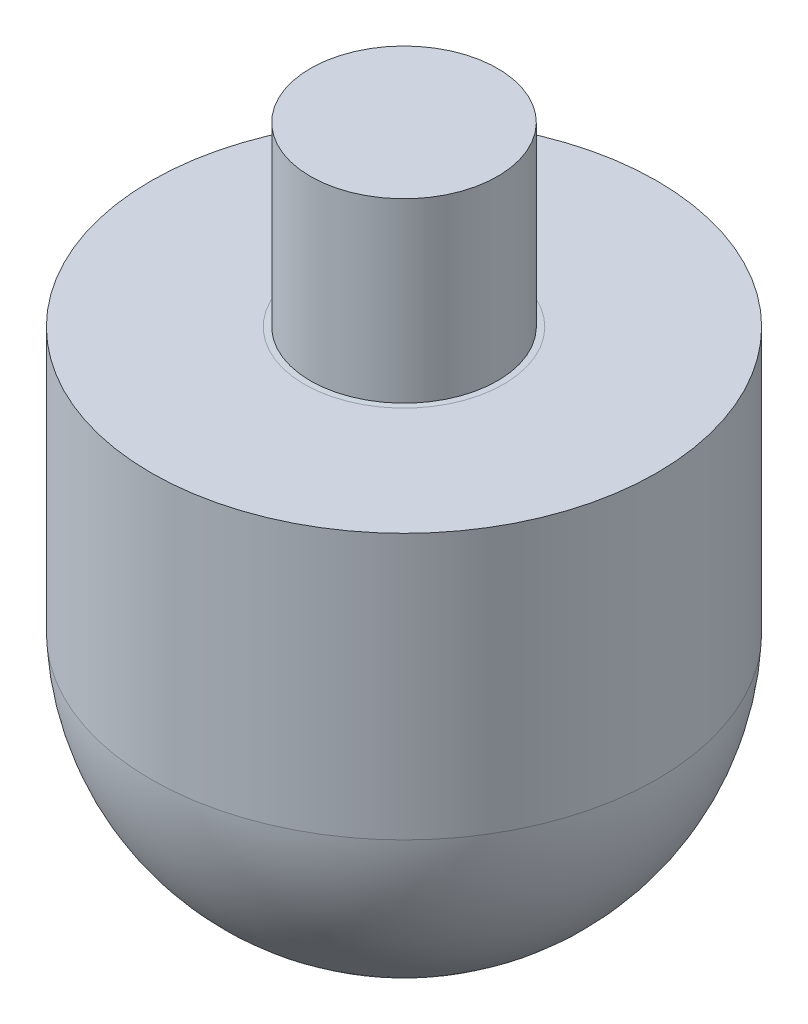
ISO-10303-21;
HEADER;
FILE_DESCRIPTION(('STEP AP214'),'2;1');
FILE_NAME('part.step','',(''),(''),'','','');
FILE_SCHEMA(('AUTOMOTIVE_DESIGN { 1 0 10303 214 1 1 1 1 }'));
ENDSEC;
DATA;
#1=APPLICATION_CONTEXT('core data for automotive mechanical design processes');
#2=APPLICATION_PROTOCOL_DEFINITION('international standard','automotive_design',2000,#1);
#3=PRODUCT_CONTEXT('',#1,'mechanical');
#4=PRODUCT('Part','Part','',(#3));
#5=PRODUCT_RELATED_PRODUCT_CATEGORY('part','',(#4));
#6=PRODUCT_DEFINITION_FORMATION('','',#4);
#7=PRODUCT_DEFINITION_CONTEXT('part definition',#1,'design');
#8=PRODUCT_DEFINITION('design','',#6,#7);
#9=PRODUCT_DEFINITION_SHAPE('','',#8);
#10=(LENGTH_UNIT() NAMED_UNIT(*) SI_UNIT(.MILLI.,.METRE.));
#11=(NAMED_UNIT(*) PLANE_ANGLE_UNIT() SI_UNIT($,.RADIAN.));
#12=(NAMED_UNIT(*) SI_UNIT($,.STERADIAN.) SOLID_ANGLE_UNIT());
#13=UNCERTAINTY_MEASURE_WITH_UNIT(LENGTH_MEASURE(1.E-05),#10,'distance_accuracy_value','');
#14=(GEOMETRIC_REPRESENTATION_CONTEXT(3) GLOBAL_UNCERTAINTY_ASSIGNED_CONTEXT((#13)) GLOBAL_UNIT_ASSIGNED_CONTEXT((#10,
#11,#12)) REPRESENTATION_CONTEXT('',''));
#15=CARTESIAN_POINT('',(0.,0.,0.));
#16=DIRECTION('',(0.,0.,1.));
#17=DIRECTION('',(1.,0.,0.));
#18=AXIS2_PLACEMENT_3D('',#15,#16,#17);
#19=CARTESIAN_POINT('',(14.2859437507659,14.9977518762108,0.));
#20=DIRECTION('',(0.,-1.,0.));
#21=DIRECTION('',(0.,0.,-1.));
#22=AXIS2_PLACEMENT_3D('',#19,#20,#21);
#23=PLANE('',#22);
#24=CARTESIAN_POINT('',(0.,14.9977518762108,0.));
#25=DIRECTION('',(0.,1.,0.));
#26=DIRECTION('',(0.,0.,1.));
#27=AXIS2_PLACEMENT_3D('',#24,#25,#26);
#28=CIRCLE('',#27,5.62499999999999);
#29=CARTESIAN_POINT('',(0.,14.9977518762108,5.62499999999999));
#30=VERTEX_POINT('',#29);
#31=EDGE_CURVE('E10',#30,#30,#28,.T.);
#32=ORIENTED_EDGE('',*,*,#31,.F.);
#33=EDGE_LOOP('',(#32));
#34=FACE_BOUND('',#33,.T.);
#35=CARTESIAN_POINT('',(0.,14.9977518762108,0.));
#36=DIRECTION('',(0.,1.,0.));
#37=DIRECTION('',(0.,0.,1.));
#38=AXIS2_PLACEMENT_3D('',#35,#36,#37);
#39=CIRCLE('',#38,14.2859437507659);
#40=CARTESIAN_POINT('',(0.,14.9977518762108,14.2859437507659));
#41=VERTEX_POINT('',#40);
#42=EDGE_CURVE('E50',#41,#41,#39,.T.);
#43=ORIENTED_EDGE('',*,*,#42,.T.);
#44=EDGE_LOOP('',(#43));
#45=FACE_BOUND('',#44,.T.);
#46=ADVANCED_FACE('F31',(#34,#45),#23,.F.);
#47=CARTESIAN_POINT('',(0.,14.9977518762108,0.));
#48=DIRECTION('',(0.,-1.,0.));
#49=DIRECTION('',(0.,0.,-1.));
#50=AXIS2_PLACEMENT_3D('',#47,#48,#49);
#51=CONICAL_SURFACE('',#50,5.62499999999999,1.56377851452459);
#52=CARTESIAN_POINT('',(0.,15.0001313461724,0.));
#53=DIRECTION('',(0.,1.,0.));
#54=DIRECTION('',(0.,0.,1.));
#55=AXIS2_PLACEMENT_3D('',#52,#53,#54);
#56=CIRCLE('',#55,5.28594406531466);
#57=CARTESIAN_POINT('',(0.,15.0001313461724,5.28594406531466));
#58=VERTEX_POINT('',#57);
#59=EDGE_CURVE('E37',#58,#58,#56,.T.);
#60=ORIENTED_EDGE('',*,*,#59,.F.);
#61=EDGE_LOOP('',(#60));
#62=FACE_BOUND('',#61,.T.);
#63=ORIENTED_EDGE('',*,*,#31,.T.);
#64=EDGE_LOOP('',(#63));
#65=FACE_BOUND('',#64,.T.);
#66=ADVANCED_FACE('F72',(#62,#65),#51,.T.);
#67=CARTESIAN_POINT('',(0.,25.0001313461724,0.));
#68=DIRECTION('',(0.,1.,0.));
#69=DIRECTION('',(0.,0.,1.));
#70=AXIS2_PLACEMENT_3D('',#67,#68,#69);
#71=CYLINDRICAL_SURFACE('',#70,5.28594406531466);
#72=CARTESIAN_POINT('',(0.,25.0001313461724,0.));
#73=DIRECTION('',(0.,1.,0.));
#74=DIRECTION('',(0.,0.,1.));
#75=AXIS2_PLACEMENT_3D('',#72,#73,#74);
#76=CIRCLE('',#75,5.28594406531466);
#77=CARTESIAN_POINT('',(0.,25.0001313461724,5.28594406531466));
#78=VERTEX_POINT('',#77);
#79=EDGE_CURVE('E41',#78,#78,#76,.T.);
#80=ORIENTED_EDGE('',*,*,#79,.F.);
#81=EDGE_LOOP('',(#80));
#82=FACE_BOUND('',#81,.T.);
#83=ORIENTED_EDGE('',*,*,#59,.T.);
#84=EDGE_LOOP('',(#83));
#85=FACE_BOUND('',#84,.T.);
#86=ADVANCED_FACE('F68',(#82,#85),#71,.T.);
#87=CARTESIAN_POINT('',(5.28594406531466,25.0001313461724,0.));
#88=DIRECTION('',(0.,-1.,0.));
#89=DIRECTION('',(0.,0.,-1.));
#90=AXIS2_PLACEMENT_3D('',#87,#88,#89);
#91=PLANE('',#90);
#92=ORIENTED_EDGE('',*,*,#79,.T.);
#93=EDGE_LOOP('',(#92));
#94=FACE_BOUND('',#93,.T.);
#95=ADVANCED_FACE('F63',(#94),#91,.F.);
#96=CARTESIAN_POINT('',(0.,0.656250000000002,0.));
#97=DIRECTION('',(0.,1.,0.));
#98=DIRECTION('',(-1.,0.,0.));
#99=AXIS2_PLACEMENT_3D('',#96,#97,#98);
#100=SPHERICAL_SURFACE('',#99,14.3010088075124);
#101=CARTESIAN_POINT('',(0.,0.,0.));
#102=DIRECTION('',(0.,1.,0.));
#103=DIRECTION('',(0.,0.,1.));
#104=AXIS2_PLACEMENT_3D('',#101,#102,#103);
#105=CIRCLE('',#104,14.2859437507659);
#106=CARTESIAN_POINT('',(0.,0.,14.2859437507659));
#107=VERTEX_POINT('',#106);
#108=EDGE_CURVE('E45',#107,#107,#105,.T.);
#109=ORIENTED_EDGE('',*,*,#108,.F.);
#110=EDGE_LOOP('',(#109));
#111=FACE_BOUND('',#110,.T.);
#112=ADVANCED_FACE('F58',(#111),#100,.T.);
#113=CARTESIAN_POINT('',(0.,25.0001313461724,0.));
#114=DIRECTION('',(0.,1.,0.));
#115=DIRECTION('',(0.,0.,1.));
#116=AXIS2_PLACEMENT_3D('',#113,#114,#115);
#117=CYLINDRICAL_SURFACE('',#116,14.2859437507659);
#118=ORIENTED_EDGE('',*,*,#42,.F.);
#119=EDGE_LOOP('',(#118));
#120=FACE_BOUND('',#119,.T.);
#121=ORIENTED_EDGE('',*,*,#108,.T.);
#122=EDGE_LOOP('',(#121));
#123=FACE_BOUND('',#122,.T.);
#124=ADVANCED_FACE('F55',(#120,#123),#117,.T.);
#125=CLOSED_SHELL('',(#46,#66,#86,#95,#112,#124));
#126=MANIFOLD_SOLID_BREP('B2',#125);
#127=ADVANCED_BREP_SHAPE_REPRESENTATION('',(#18,#126),#14);
#128=SHAPE_DEFINITION_REPRESENTATION(#9,#127);
ENDSEC;
END-ISO-10303-21;
